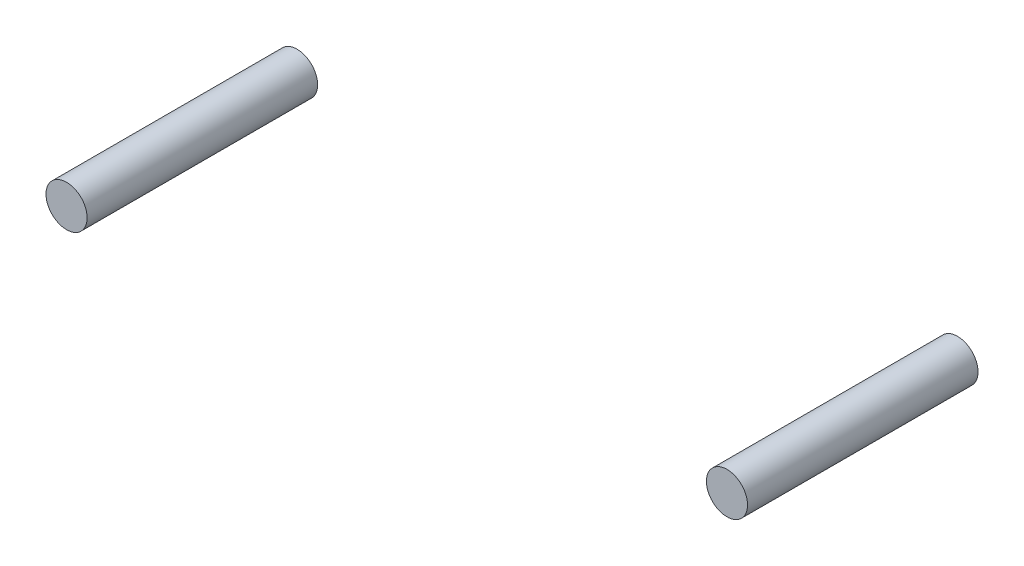
ISO-10303-21;
HEADER;
FILE_DESCRIPTION(('STEP AP214'),'2;1');
FILE_NAME('part.step','',(''),(''),'','','');
FILE_SCHEMA(('AUTOMOTIVE_DESIGN { 1 0 10303 214 1 1 1 1 }'));
ENDSEC;
DATA;
#1=APPLICATION_CONTEXT('core data for automotive mechanical design processes');
#2=APPLICATION_PROTOCOL_DEFINITION('international standard','automotive_design',2000,#1);
#3=PRODUCT_CONTEXT('',#1,'mechanical');
#4=PRODUCT('Part','Part','',(#3));
#5=PRODUCT_RELATED_PRODUCT_CATEGORY('part','',(#4));
#6=PRODUCT_DEFINITION_FORMATION('','',#4);
#7=PRODUCT_DEFINITION_CONTEXT('part definition',#1,'design');
#8=PRODUCT_DEFINITION('design','',#6,#7);
#9=PRODUCT_DEFINITION_SHAPE('','',#8);
#10=(LENGTH_UNIT() NAMED_UNIT(*) SI_UNIT(.MILLI.,.METRE.));
#11=(NAMED_UNIT(*) PLANE_ANGLE_UNIT() SI_UNIT($,.RADIAN.));
#12=(NAMED_UNIT(*) SI_UNIT($,.STERADIAN.) SOLID_ANGLE_UNIT());
#13=UNCERTAINTY_MEASURE_WITH_UNIT(LENGTH_MEASURE(1.E-05),#10,'distance_accuracy_value','');
#14=(GEOMETRIC_REPRESENTATION_CONTEXT(3) GLOBAL_UNCERTAINTY_ASSIGNED_CONTEXT((#13)) GLOBAL_UNIT_ASSIGNED_CONTEXT((#10,
#11,#12)) REPRESENTATION_CONTEXT('',''));
#15=CARTESIAN_POINT('',(0.,0.,0.));
#16=DIRECTION('',(0.,0.,1.));
#17=DIRECTION('',(1.,0.,0.));
#18=AXIS2_PLACEMENT_3D('',#15,#16,#17);
#19=CARTESIAN_POINT('',(0.,0.,48.2981000000003));
#20=DIRECTION('',(0.,0.,1.));
#21=DIRECTION('',(1.,0.,0.));
#22=AXIS2_PLACEMENT_3D('',#19,#20,#21);
#23=PLANE('',#22);
#24=CARTESIAN_POINT('',(0.,0.,48.2981000000003));
#25=DIRECTION('',(0.,0.,1.));
#26=DIRECTION('',(1.,0.,0.));
#27=AXIS2_PLACEMENT_3D('',#24,#25,#26);
#28=CIRCLE('',#27,6.35);
#29=CARTESIAN_POINT('',(6.34999999999999,0.,48.2981000000003));
#30=VERTEX_POINT('',#29);
#31=EDGE_CURVE('E11',#30,#30,#28,.F.);
#32=ORIENTED_EDGE('',*,*,#31,.F.);
#33=EDGE_LOOP('',(#32));
#34=FACE_BOUND('',#33,.T.);
#35=ADVANCED_FACE('F39',(#34),#23,.T.);
#36=CARTESIAN_POINT('',(0.,0.,-22.86));
#37=DIRECTION('',(0.,0.,-1.));
#38=DIRECTION('',(-1.,0.,0.));
#39=AXIS2_PLACEMENT_3D('',#36,#37,#38);
#40=PLANE('',#39);
#41=CARTESIAN_POINT('',(0.,0.,-22.86));
#42=DIRECTION('',(0.,0.,-1.));
#43=DIRECTION('',(-1.,0.,0.));
#44=AXIS2_PLACEMENT_3D('',#41,#42,#43);
#45=CIRCLE('',#44,6.35);
#46=CARTESIAN_POINT('',(-6.34999999999998,0.,-22.86));
#47=VERTEX_POINT('',#46);
#48=EDGE_CURVE('E45',#47,#47,#45,.T.);
#49=ORIENTED_EDGE('',*,*,#48,.T.);
#50=EDGE_LOOP('',(#49));
#51=FACE_BOUND('',#50,.T.);
#52=ADVANCED_FACE('F51',(#51),#40,.T.);
#53=CARTESIAN_POINT('',(0.,0.,66.258612242139));
#54=DIRECTION('',(0.,0.,-1.));
#55=DIRECTION('',(-1.,0.,0.));
#56=AXIS2_PLACEMENT_3D('',#53,#54,#55);
#57=CYLINDRICAL_SURFACE('',#56,6.35);
#58=ORIENTED_EDGE('',*,*,#48,.F.);
#59=EDGE_LOOP('',(#58));
#60=FACE_BOUND('',#59,.T.);
#61=ORIENTED_EDGE('',*,*,#31,.T.);
#62=EDGE_LOOP('',(#61));
#63=FACE_BOUND('',#62,.T.);
#64=ADVANCED_FACE('F53',(#60,#63),#57,.T.);
#65=CLOSED_SHELL('',(#35,#52,#64));
#66=MANIFOLD_SOLID_BREP('B2',#65);
#67=CARTESIAN_POINT('',(0.,0.,48.2981000000003));
#68=DIRECTION('',(0.,0.,1.));
#69=DIRECTION('',(1.,0.,0.));
#70=AXIS2_PLACEMENT_3D('',#67,#68,#69);
#71=PLANE('',#70);
#72=CARTESIAN_POINT('',(-203.888829504421,-25.1744171373861,48.2981000000003));
#73=DIRECTION('',(0.,0.,1.));
#74=DIRECTION('',(1.,0.,0.));
#75=AXIS2_PLACEMENT_3D('',#72,#73,#74);
#76=CIRCLE('',#75,6.35000000000011);
#77=CARTESIAN_POINT('',(-197.538829504421,-25.1744171373861,48.2981000000003));
#78=VERTEX_POINT('',#77);
#79=EDGE_CURVE('E38',#78,#78,#76,.F.);
#80=ORIENTED_EDGE('',*,*,#79,.F.);
#81=EDGE_LOOP('',(#80));
#82=FACE_BOUND('',#81,.T.);
#83=ADVANCED_FACE('F80',(#82),#71,.T.);
#84=CARTESIAN_POINT('',(-203.888829504421,-25.1744171373861,-22.8600000000001));
#85=DIRECTION('',(0.,0.,-1.));
#86=DIRECTION('',(-1.,0.,0.));
#87=AXIS2_PLACEMENT_3D('',#84,#85,#86);
#88=PLANE('',#87);
#89=CARTESIAN_POINT('',(-203.888829504421,-25.1744171373861,-22.8600000000001));
#90=DIRECTION('',(0.,0.,-1.));
#91=DIRECTION('',(-1.,0.,0.));
#92=AXIS2_PLACEMENT_3D('',#89,#90,#91);
#93=CIRCLE('',#92,6.35000000000011);
#94=CARTESIAN_POINT('',(-210.238829504421,-25.1744171373861,-22.8600000000001));
#95=VERTEX_POINT('',#94);
#96=EDGE_CURVE('E86',#95,#95,#93,.T.);
#97=ORIENTED_EDGE('',*,*,#96,.T.);
#98=EDGE_LOOP('',(#97));
#99=FACE_BOUND('',#98,.T.);
#100=ADVANCED_FACE('F92',(#99),#88,.T.);
#101=CARTESIAN_POINT('',(-203.888829504421,-25.1744171373861,66.2586122421389));
#102=DIRECTION('',(0.,0.,-1.));
#103=DIRECTION('',(-1.,0.,0.));
#104=AXIS2_PLACEMENT_3D('',#101,#102,#103);
#105=CYLINDRICAL_SURFACE('',#104,6.35000000000011);
#106=ORIENTED_EDGE('',*,*,#96,.F.);
#107=EDGE_LOOP('',(#106));
#108=FACE_BOUND('',#107,.T.);
#109=ORIENTED_EDGE('',*,*,#79,.T.);
#110=EDGE_LOOP('',(#109));
#111=FACE_BOUND('',#110,.T.);
#112=ADVANCED_FACE('F94',(#108,#111),#105,.T.);
#113=CLOSED_SHELL('',(#83,#100,#112));
#114=MANIFOLD_SOLID_BREP('B6',#113);
#115=ADVANCED_BREP_SHAPE_REPRESENTATION('',(#18,#66,#114),#14);
#116=SHAPE_DEFINITION_REPRESENTATION(#9,#115);
ENDSEC;
END-ISO-10303-21;
